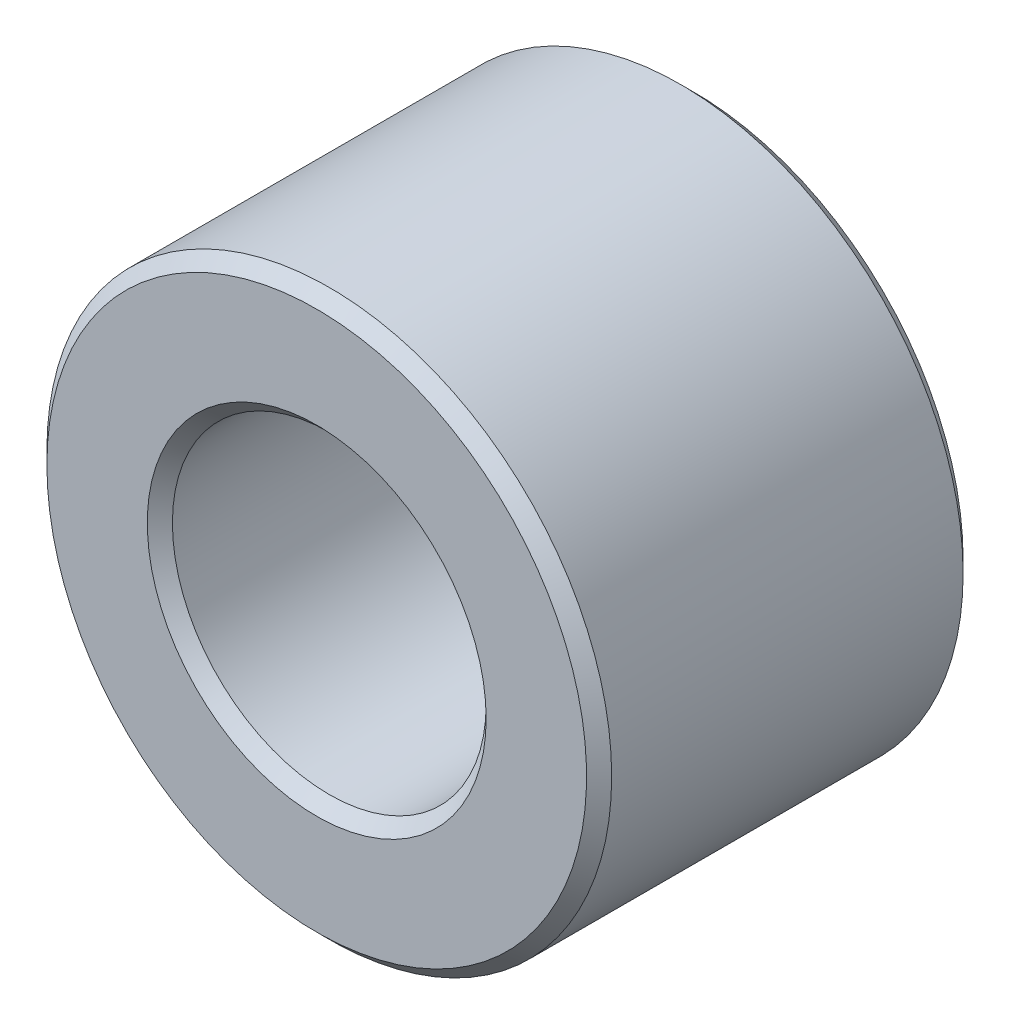
ISO-10303-21;
HEADER;
FILE_DESCRIPTION(('STEP AP214'),'2;1');
FILE_NAME('part.step','',(''),(''),'','','');
FILE_SCHEMA(('AUTOMOTIVE_DESIGN { 1 0 10303 214 1 1 1 1 }'));
ENDSEC;
DATA;
#1=APPLICATION_CONTEXT('core data for automotive mechanical design processes');
#2=APPLICATION_PROTOCOL_DEFINITION('international standard','automotive_design',2000,#1);
#3=PRODUCT_CONTEXT('',#1,'mechanical');
#4=PRODUCT('Part','Part','',(#3));
#5=PRODUCT_RELATED_PRODUCT_CATEGORY('part','',(#4));
#6=PRODUCT_DEFINITION_FORMATION('','',#4);
#7=PRODUCT_DEFINITION_CONTEXT('part definition',#1,'design');
#8=PRODUCT_DEFINITION('design','',#6,#7);
#9=PRODUCT_DEFINITION_SHAPE('','',#8);
#10=(LENGTH_UNIT() NAMED_UNIT(*) SI_UNIT(.MILLI.,.METRE.));
#11=(NAMED_UNIT(*) PLANE_ANGLE_UNIT() SI_UNIT($,.RADIAN.));
#12=(NAMED_UNIT(*) SI_UNIT($,.STERADIAN.) SOLID_ANGLE_UNIT());
#13=UNCERTAINTY_MEASURE_WITH_UNIT(LENGTH_MEASURE(1.E-05),#10,'distance_accuracy_value','');
#14=(GEOMETRIC_REPRESENTATION_CONTEXT(3) GLOBAL_UNCERTAINTY_ASSIGNED_CONTEXT((#13)) GLOBAL_UNIT_ASSIGNED_CONTEXT((#10,
#11,#12)) REPRESENTATION_CONTEXT('',''));
#15=CARTESIAN_POINT('',(0.,0.,0.));
#16=DIRECTION('',(0.,0.,1.));
#17=DIRECTION('',(1.,0.,0.));
#18=AXIS2_PLACEMENT_3D('',#15,#16,#17);
#19=CARTESIAN_POINT('',(0.,0.,0.));
#20=DIRECTION('',(0.,0.,1.));
#21=DIRECTION('',(1.,0.,0.));
#22=AXIS2_PLACEMENT_3D('',#19,#20,#21);
#23=CYLINDRICAL_SURFACE('',#22,1.25);
#24=CARTESIAN_POINT('',(0.,0.,0.100000000031741));
#25=DIRECTION('',(0.,0.,-1.));
#26=DIRECTION('',(-1.,0.,0.));
#27=AXIS2_PLACEMENT_3D('',#24,#25,#26);
#28=CIRCLE('',#27,1.24999999997044);
#29=CARTESIAN_POINT('',(-1.24999999997044,0.,0.100000000031741));
#30=VERTEX_POINT('',#29);
#31=EDGE_CURVE('E34',#30,#30,#28,.T.);
#32=ORIENTED_EDGE('',*,*,#31,.T.);
#33=EDGE_LOOP('',(#32));
#34=FACE_BOUND('',#33,.T.);
#35=CARTESIAN_POINT('',(0.,0.,2.900000000011));
#36=DIRECTION('',(0.,0.,1.));
#37=DIRECTION('',(-1.,0.,0.));
#38=AXIS2_PLACEMENT_3D('',#35,#36,#37);
#39=CIRCLE('',#38,1.24999999997044);
#40=CARTESIAN_POINT('',(-1.24999999997044,0.,2.900000000011));
#41=VERTEX_POINT('',#40);
#42=EDGE_CURVE('E37',#41,#41,#39,.T.);
#43=ORIENTED_EDGE('',*,*,#42,.T.);
#44=EDGE_LOOP('',(#43));
#45=FACE_BOUND('',#44,.T.);
#46=ADVANCED_FACE('F15',(#34,#45),#23,.F.);
#47=CARTESIAN_POINT('',(0.,0.,2.99999999992906));
#48=DIRECTION('',(0.,0.,1.));
#49=DIRECTION('',(1.,0.,0.));
#50=AXIS2_PLACEMENT_3D('',#47,#48,#49);
#51=CONICAL_SURFACE('',#50,1.34999999994534,0.785398163397448);
#52=CARTESIAN_POINT('',(0.,0.,2.99999999998591));
#53=DIRECTION('',(0.,0.,1.));
#54=DIRECTION('',(1.,0.,0.));
#55=AXIS2_PLACEMENT_3D('',#52,#53,#54);
#56=CIRCLE('',#55,1.35000000000218);
#57=CARTESIAN_POINT('',(1.35000000000218,0.,2.99999999998591));
#58=VERTEX_POINT('',#57);
#59=EDGE_CURVE('E18',#58,#58,#56,.T.);
#60=ORIENTED_EDGE('',*,*,#59,.T.);
#61=EDGE_LOOP('',(#60));
#62=FACE_BOUND('',#61,.T.);
#63=ORIENTED_EDGE('',*,*,#42,.F.);
#64=EDGE_LOOP('',(#63));
#65=FACE_BOUND('',#64,.T.);
#66=ADVANCED_FACE('F55',(#62,#65),#51,.F.);
#67=CARTESIAN_POINT('',(0.,0.,1.13686837721616E-10));
#68=DIRECTION('',(0.,0.,-1.));
#69=DIRECTION('',(-1.,0.,0.));
#70=AXIS2_PLACEMENT_3D('',#67,#68,#69);
#71=CONICAL_SURFACE('',#70,1.34999999994534,0.785398163397448);
#72=CARTESIAN_POINT('',(0.,0.,0.));
#73=DIRECTION('',(0.,0.,-1.));
#74=DIRECTION('',(-1.,0.,0.));
#75=AXIS2_PLACEMENT_3D('',#72,#73,#74);
#76=CIRCLE('',#75,1.35000000005903);
#77=CARTESIAN_POINT('',(-1.35000000005903,0.,0.));
#78=VERTEX_POINT('',#77);
#79=EDGE_CURVE('E48',#78,#78,#76,.F.);
#80=ORIENTED_EDGE('',*,*,#79,.F.);
#81=EDGE_LOOP('',(#80));
#82=FACE_BOUND('',#81,.T.);
#83=ORIENTED_EDGE('',*,*,#31,.F.);
#84=EDGE_LOOP('',(#83));
#85=FACE_BOUND('',#84,.T.);
#86=ADVANCED_FACE('F62',(#82,#85),#71,.F.);
#87=CARTESIAN_POINT('',(0.,0.,3.));
#88=DIRECTION('',(0.,0.,-1.));
#89=DIRECTION('',(-1.,0.,0.));
#90=AXIS2_PLACEMENT_3D('',#87,#88,#89);
#91=PLANE('',#90);
#92=ORIENTED_EDGE('',*,*,#59,.F.);
#93=EDGE_LOOP('',(#92));
#94=FACE_BOUND('',#93,.T.);
#95=CARTESIAN_POINT('',(0.,0.,2.99999999992906));
#96=DIRECTION('',(0.,0.,-1.));
#97=DIRECTION('',(-1.,0.,0.));
#98=AXIS2_PLACEMENT_3D('',#95,#96,#97);
#99=CIRCLE('',#98,2.15000000002874);
#100=CARTESIAN_POINT('',(-2.15000000002874,0.,2.99999999992906));
#101=VERTEX_POINT('',#100);
#102=EDGE_CURVE('E46',#101,#101,#99,.T.);
#103=ORIENTED_EDGE('',*,*,#102,.F.);
#104=EDGE_LOOP('',(#103));
#105=FACE_BOUND('',#104,.T.);
#106=ADVANCED_FACE('F58',(#94,#105),#91,.F.);
#107=CARTESIAN_POINT('',(0.,0.,0.));
#108=DIRECTION('',(0.,0.,-1.));
#109=DIRECTION('',(-1.,0.,0.));
#110=AXIS2_PLACEMENT_3D('',#107,#108,#109);
#111=PLANE('',#110);
#112=ORIENTED_EDGE('',*,*,#79,.T.);
#113=EDGE_LOOP('',(#112));
#114=FACE_BOUND('',#113,.T.);
#115=CARTESIAN_POINT('',(0.,0.,5.6843418860808E-11));
#116=DIRECTION('',(0.,0.,1.));
#117=DIRECTION('',(1.,0.,0.));
#118=AXIS2_PLACEMENT_3D('',#115,#116,#117);
#119=CIRCLE('',#118,2.15000000002874);
#120=CARTESIAN_POINT('',(2.15000000002874,0.,5.6843418860808E-11));
#121=VERTEX_POINT('',#120);
#122=EDGE_CURVE('E27',#121,#121,#119,.T.);
#123=ORIENTED_EDGE('',*,*,#122,.F.);
#124=EDGE_LOOP('',(#123));
#125=FACE_BOUND('',#124,.T.);
#126=ADVANCED_FACE('F61',(#114,#125),#111,.T.);
#127=CARTESIAN_POINT('',(0.,0.,2.90000000012469));
#128=DIRECTION('',(0.,0.,-1.));
#129=DIRECTION('',(-1.,0.,0.));
#130=AXIS2_PLACEMENT_3D('',#127,#128,#129);
#131=CONICAL_SURFACE('',#130,2.24999999988995,0.785398163681665);
#132=CARTESIAN_POINT('',(0.,0.,2.9));
#133=DIRECTION('',(0.,0.,1.));
#134=DIRECTION('',(1.,0.,0.));
#135=AXIS2_PLACEMENT_3D('',#132,#133,#134);
#136=CIRCLE('',#135,2.25);
#137=CARTESIAN_POINT('',(2.25,0.,2.9));
#138=VERTEX_POINT('',#137);
#139=EDGE_CURVE('E22',#138,#138,#136,.F.);
#140=ORIENTED_EDGE('',*,*,#139,.F.);
#141=EDGE_LOOP('',(#140));
#142=FACE_BOUND('',#141,.T.);
#143=ORIENTED_EDGE('',*,*,#102,.T.);
#144=EDGE_LOOP('',(#143));
#145=FACE_BOUND('',#144,.T.);
#146=ADVANCED_FACE('F66',(#142,#145),#131,.T.);
#147=CARTESIAN_POINT('',(0.,0.,0.0999999999180545));
#148=DIRECTION('',(0.,0.,1.));
#149=DIRECTION('',(1.,0.,0.));
#150=AXIS2_PLACEMENT_3D('',#147,#148,#149);
#151=CONICAL_SURFACE('',#150,2.2499999999468,0.785398163681665);
#152=ORIENTED_EDGE('',*,*,#122,.T.);
#153=EDGE_LOOP('',(#152));
#154=FACE_BOUND('',#153,.T.);
#155=CARTESIAN_POINT('',(0.,0.,0.1));
#156=DIRECTION('',(0.,0.,1.));
#157=DIRECTION('',(1.,0.,0.));
#158=AXIS2_PLACEMENT_3D('',#155,#156,#157);
#159=CIRCLE('',#158,2.25);
#160=CARTESIAN_POINT('',(2.25,0.,0.1));
#161=VERTEX_POINT('',#160);
#162=EDGE_CURVE('E10',#161,#161,#159,.T.);
#163=ORIENTED_EDGE('',*,*,#162,.F.);
#164=EDGE_LOOP('',(#163));
#165=FACE_BOUND('',#164,.T.);
#166=ADVANCED_FACE('F68',(#154,#165),#151,.T.);
#167=CARTESIAN_POINT('',(0.,0.,0.));
#168=DIRECTION('',(0.,0.,1.));
#169=DIRECTION('',(1.,0.,0.));
#170=AXIS2_PLACEMENT_3D('',#167,#168,#169);
#171=CYLINDRICAL_SURFACE('',#170,2.25);
#172=ORIENTED_EDGE('',*,*,#162,.T.);
#173=EDGE_LOOP('',(#172));
#174=FACE_BOUND('',#173,.T.);
#175=ORIENTED_EDGE('',*,*,#139,.T.);
#176=EDGE_LOOP('',(#175));
#177=FACE_BOUND('',#176,.T.);
#178=ADVANCED_FACE('F77',(#174,#177),#171,.T.);
#179=CLOSED_SHELL('',(#46,#66,#86,#106,#126,#146,#166,#178));
#180=MANIFOLD_SOLID_BREP('B1',#179);
#181=ADVANCED_BREP_SHAPE_REPRESENTATION('',(#18,#180),#14);
#182=SHAPE_DEFINITION_REPRESENTATION(#9,#181);
ENDSEC;
END-ISO-10303-21;
